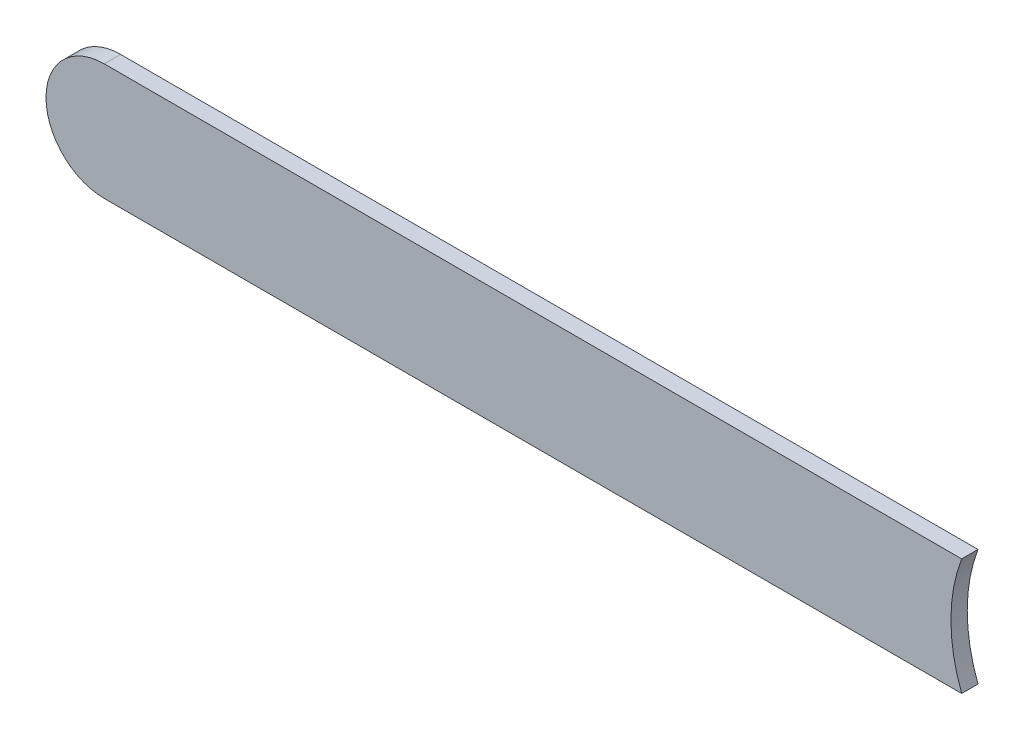
ISO-10303-21;
HEADER;
FILE_DESCRIPTION(('STEP AP214'),'2;1');
FILE_NAME('part.step','',(''),(''),'','','');
FILE_SCHEMA(('AUTOMOTIVE_DESIGN { 1 0 10303 214 1 1 1 1 }'));
ENDSEC;
DATA;
#1=APPLICATION_CONTEXT('core data for automotive mechanical design processes');
#2=APPLICATION_PROTOCOL_DEFINITION('international standard','automotive_design',2000,#1);
#3=PRODUCT_CONTEXT('',#1,'mechanical');
#4=PRODUCT('Part','Part','',(#3));
#5=PRODUCT_RELATED_PRODUCT_CATEGORY('part','',(#4));
#6=PRODUCT_DEFINITION_FORMATION('','',#4);
#7=PRODUCT_DEFINITION_CONTEXT('part definition',#1,'design');
#8=PRODUCT_DEFINITION('design','',#6,#7);
#9=PRODUCT_DEFINITION_SHAPE('','',#8);
#10=(LENGTH_UNIT() NAMED_UNIT(*) SI_UNIT(.MILLI.,.METRE.));
#11=(NAMED_UNIT(*) PLANE_ANGLE_UNIT() SI_UNIT($,.RADIAN.));
#12=(NAMED_UNIT(*) SI_UNIT($,.STERADIAN.) SOLID_ANGLE_UNIT());
#13=UNCERTAINTY_MEASURE_WITH_UNIT(LENGTH_MEASURE(1.E-05),#10,'distance_accuracy_value','');
#14=(GEOMETRIC_REPRESENTATION_CONTEXT(3) GLOBAL_UNCERTAINTY_ASSIGNED_CONTEXT((#13)) GLOBAL_UNIT_ASSIGNED_CONTEXT((#10,
#11,#12)) REPRESENTATION_CONTEXT('',''));
#15=CARTESIAN_POINT('',(0.,0.,0.));
#16=DIRECTION('',(0.,0.,1.));
#17=DIRECTION('',(1.,0.,0.));
#18=AXIS2_PLACEMENT_3D('',#15,#16,#17);
#19=CARTESIAN_POINT('',(82.81696162,66.55998118,0.));
#20=DIRECTION('',(0.,1.,0.));
#21=DIRECTION('',(1.,0.,0.));
#22=AXIS2_PLACEMENT_3D('',#19,#20,#21);
#23=PLANE('',#22);
#24=DIRECTION('',(1.,0.,0.));
#25=VECTOR('',#24,1.);
#26=CARTESIAN_POINT('',(82.81696162,66.55998118,0.03556));
#27=LINE('',#26,#25);
#28=CARTESIAN_POINT('',(82.81696162,66.55998118,0.03556));
#29=VERTEX_POINT('',#28);
#30=CARTESIAN_POINT('',(84.6848214470226,66.55998118,0.03556));
#31=VERTEX_POINT('',#30);
#32=EDGE_CURVE('E11',#29,#31,#27,.T.);
#33=ORIENTED_EDGE('',*,*,#32,.F.);
#34=DIRECTION('',(0.,0.,1.));
#35=VECTOR('',#34,1.);
#36=CARTESIAN_POINT('',(82.81696162,66.55998118,0.));
#37=LINE('',#36,#35);
#38=CARTESIAN_POINT('',(82.81696162,66.55998118,0.));
#39=VERTEX_POINT('',#38);
#40=EDGE_CURVE('E24',#39,#29,#37,.T.);
#41=ORIENTED_EDGE('',*,*,#40,.F.);
#42=DIRECTION('',(1.,0.,0.));
#43=VECTOR('',#42,1.);
#44=CARTESIAN_POINT('',(82.81696162,66.55998118,0.));
#45=LINE('',#44,#43);
#46=CARTESIAN_POINT('',(84.6848214470226,66.55998118,0.));
#47=VERTEX_POINT('',#46);
#48=EDGE_CURVE('E75',#39,#47,#45,.T.);
#49=ORIENTED_EDGE('',*,*,#48,.T.);
#50=DIRECTION('',(0.,0.,1.));
#51=VECTOR('',#50,1.);
#52=CARTESIAN_POINT('',(84.6848214470226,66.55998118,0.));
#53=LINE('',#52,#51);
#54=EDGE_CURVE('E37',#47,#31,#53,.T.);
#55=ORIENTED_EDGE('',*,*,#54,.T.);
#56=EDGE_LOOP('',(#33,#41,#49,#55));
#57=FACE_BOUND('',#56,.T.);
#58=ADVANCED_FACE('F17',(#57),#23,.F.);
#59=CARTESIAN_POINT('',(85.01697246,66.68697356,0.));
#60=DIRECTION('',(0.,0.,-1.));
#61=DIRECTION('',(1.,0.,0.));
#62=AXIS2_PLACEMENT_3D('',#59,#60,#61);
#63=CYLINDRICAL_SURFACE('',#62,0.3556);
#64=DIRECTION('',(0.,0.,1.));
#65=VECTOR('',#64,1.);
#66=CARTESIAN_POINT('',(84.6848272741822,66.81398118,0.));
#67=LINE('',#66,#65);
#68=CARTESIAN_POINT('',(84.6848272741822,66.81398118,0.));
#69=VERTEX_POINT('',#68);
#70=CARTESIAN_POINT('',(84.6848272741822,66.81398118,0.03556));
#71=VERTEX_POINT('',#70);
#72=EDGE_CURVE('E67',#69,#71,#67,.T.);
#73=ORIENTED_EDGE('',*,*,#72,.T.);
#74=CARTESIAN_POINT('',(85.01697246,66.68697356,0.03556));
#75=DIRECTION('',(0.,0.,1.));
#76=DIRECTION('',(1.,0.,0.));
#77=AXIS2_PLACEMENT_3D('',#74,#75,#76);
#78=CIRCLE('',#77,0.3556);
#79=EDGE_CURVE('E82',#71,#31,#78,.T.);
#80=ORIENTED_EDGE('',*,*,#79,.T.);
#81=ORIENTED_EDGE('',*,*,#54,.F.);
#82=CARTESIAN_POINT('',(85.01697246,66.68697356,0.));
#83=DIRECTION('',(0.,0.,1.));
#84=DIRECTION('',(1.,0.,0.));
#85=AXIS2_PLACEMENT_3D('',#82,#83,#84);
#86=CIRCLE('',#85,0.3556);
#87=EDGE_CURVE('E80',#69,#47,#86,.T.);
#88=ORIENTED_EDGE('',*,*,#87,.F.);
#89=EDGE_LOOP('',(#73,#80,#81,#88));
#90=FACE_BOUND('',#89,.T.);
#91=ADVANCED_FACE('F88',(#90),#63,.F.);
#92=CARTESIAN_POINT('',(84.6848272741822,66.81398118,0.));
#93=DIRECTION('',(0.,-1.,0.));
#94=DIRECTION('',(-1.,0.,0.));
#95=AXIS2_PLACEMENT_3D('',#92,#93,#94);
#96=PLANE('',#95);
#97=DIRECTION('',(-1.,0.,0.));
#98=VECTOR('',#97,1.);
#99=CARTESIAN_POINT('',(85.01696484,66.81398118,0.03556));
#100=LINE('',#99,#98);
#101=CARTESIAN_POINT('',(82.81696162,66.81398118,0.03556));
#102=VERTEX_POINT('',#101);
#103=EDGE_CURVE('E71',#71,#102,#100,.T.);
#104=ORIENTED_EDGE('',*,*,#103,.F.);
#105=ORIENTED_EDGE('',*,*,#72,.F.);
#106=DIRECTION('',(-1.,0.,0.));
#107=VECTOR('',#106,1.);
#108=CARTESIAN_POINT('',(85.01696484,66.81398118,0.));
#109=LINE('',#108,#107);
#110=CARTESIAN_POINT('',(82.81696162,66.81398118,0.));
#111=VERTEX_POINT('',#110);
#112=EDGE_CURVE('E63',#69,#111,#109,.T.);
#113=ORIENTED_EDGE('',*,*,#112,.T.);
#114=DIRECTION('',(0.,0.,1.));
#115=VECTOR('',#114,1.);
#116=CARTESIAN_POINT('',(82.81696162,66.81398118,0.));
#117=LINE('',#116,#115);
#118=EDGE_CURVE('E53',#111,#102,#117,.T.);
#119=ORIENTED_EDGE('',*,*,#118,.T.);
#120=EDGE_LOOP('',(#104,#105,#113,#119));
#121=FACE_BOUND('',#120,.T.);
#122=ADVANCED_FACE('F66',(#121),#96,.F.);
#123=CARTESIAN_POINT('',(82.81696162,66.68698118,0.));
#124=DIRECTION('',(0.,0.,-1.));
#125=DIRECTION('',(-1.11896493820492E-13,1.,0.));
#126=AXIS2_PLACEMENT_3D('',#123,#124,#125);
#127=CYLINDRICAL_SURFACE('',#126,0.127);
#128=CARTESIAN_POINT('',(82.81696162,66.68698118,0.03556));
#129=DIRECTION('',(0.,0.,1.));
#130=DIRECTION('',(-1.11896493820492E-13,1.,0.));
#131=AXIS2_PLACEMENT_3D('',#128,#129,#130);
#132=CIRCLE('',#131,0.127);
#133=EDGE_CURVE('E59',#102,#29,#132,.T.);
#134=ORIENTED_EDGE('',*,*,#133,.F.);
#135=ORIENTED_EDGE('',*,*,#118,.F.);
#136=CARTESIAN_POINT('',(82.81696162,66.68698118,0.));
#137=DIRECTION('',(0.,0.,1.));
#138=DIRECTION('',(-1.11896493820492E-13,1.,0.));
#139=AXIS2_PLACEMENT_3D('',#136,#137,#138);
#140=CIRCLE('',#139,0.127);
#141=EDGE_CURVE('E57',#111,#39,#140,.T.);
#142=ORIENTED_EDGE('',*,*,#141,.T.);
#143=ORIENTED_EDGE('',*,*,#40,.T.);
#144=EDGE_LOOP('',(#134,#135,#142,#143));
#145=FACE_BOUND('',#144,.T.);
#146=ADVANCED_FACE('F55',(#145),#127,.T.);
#147=CARTESIAN_POINT('',(82.81696162,66.55998118,0.));
#148=DIRECTION('',(0.,0.,-1.));
#149=DIRECTION('',(-1.,0.,0.));
#150=AXIS2_PLACEMENT_3D('',#147,#148,#149);
#151=PLANE('',#150);
#152=ORIENTED_EDGE('',*,*,#48,.F.);
#153=ORIENTED_EDGE('',*,*,#141,.F.);
#154=ORIENTED_EDGE('',*,*,#112,.F.);
#155=ORIENTED_EDGE('',*,*,#87,.T.);
#156=EDGE_LOOP('',(#152,#153,#154,#155));
#157=FACE_BOUND('',#156,.T.);
#158=ADVANCED_FACE('F74',(#157),#151,.T.);
#159=CARTESIAN_POINT('',(82.81696162,66.55998118,0.03556));
#160=DIRECTION('',(0.,0.,-1.));
#161=DIRECTION('',(-1.,0.,0.));
#162=AXIS2_PLACEMENT_3D('',#159,#160,#161);
#163=PLANE('',#162);
#164=ORIENTED_EDGE('',*,*,#133,.T.);
#165=ORIENTED_EDGE('',*,*,#32,.T.);
#166=ORIENTED_EDGE('',*,*,#79,.F.);
#167=ORIENTED_EDGE('',*,*,#103,.T.);
#168=EDGE_LOOP('',(#164,#165,#166,#167));
#169=FACE_BOUND('',#168,.T.);
#170=ADVANCED_FACE('F91',(#169),#163,.F.);
#171=CLOSED_SHELL('',(#58,#91,#122,#146,#158,#170));
#172=MANIFOLD_SOLID_BREP('B1',#171);
#173=ADVANCED_BREP_SHAPE_REPRESENTATION('',(#18,#172),#14);
#174=SHAPE_DEFINITION_REPRESENTATION(#9,#173);
ENDSEC;
END-ISO-10303-21;
